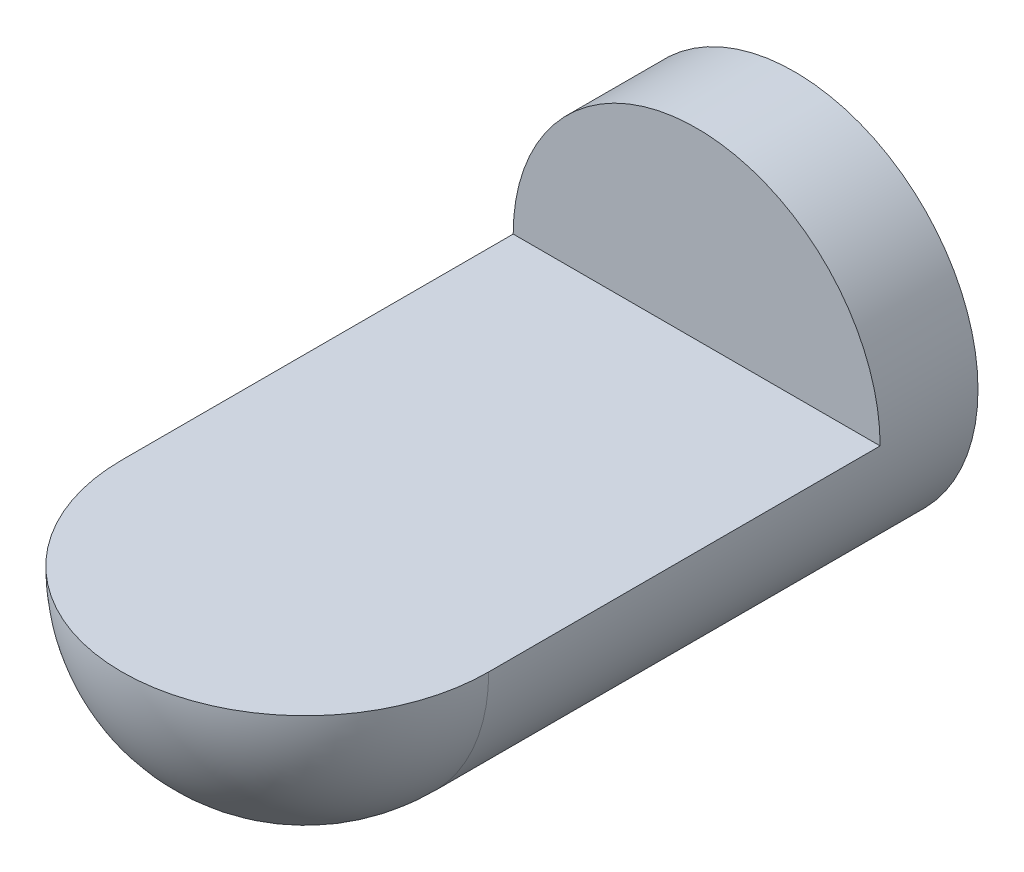
ISO-10303-21;
HEADER;
FILE_DESCRIPTION(('STEP AP214'),'2;1');
FILE_NAME('part.step','',(''),(''),'','','');
FILE_SCHEMA(('AUTOMOTIVE_DESIGN { 1 0 10303 214 1 1 1 1 }'));
ENDSEC;
DATA;
#1=APPLICATION_CONTEXT('core data for automotive mechanical design processes');
#2=APPLICATION_PROTOCOL_DEFINITION('international standard','automotive_design',2000,#1);
#3=PRODUCT_CONTEXT('',#1,'mechanical');
#4=PRODUCT('Part','Part','',(#3));
#5=PRODUCT_RELATED_PRODUCT_CATEGORY('part','',(#4));
#6=PRODUCT_DEFINITION_FORMATION('','',#4);
#7=PRODUCT_DEFINITION_CONTEXT('part definition',#1,'design');
#8=PRODUCT_DEFINITION('design','',#6,#7);
#9=PRODUCT_DEFINITION_SHAPE('','',#8);
#10=(LENGTH_UNIT() NAMED_UNIT(*) SI_UNIT(.MILLI.,.METRE.));
#11=(NAMED_UNIT(*) PLANE_ANGLE_UNIT() SI_UNIT($,.RADIAN.));
#12=(NAMED_UNIT(*) SI_UNIT($,.STERADIAN.) SOLID_ANGLE_UNIT());
#13=UNCERTAINTY_MEASURE_WITH_UNIT(LENGTH_MEASURE(1.E-05),#10,'distance_accuracy_value','');
#14=(GEOMETRIC_REPRESENTATION_CONTEXT(3) GLOBAL_UNCERTAINTY_ASSIGNED_CONTEXT((#13)) GLOBAL_UNIT_ASSIGNED_CONTEXT((#10,
#11,#12)) REPRESENTATION_CONTEXT('',''));
#15=CARTESIAN_POINT('',(0.,0.,0.));
#16=DIRECTION('',(0.,0.,1.));
#17=DIRECTION('',(1.,0.,0.));
#18=AXIS2_PLACEMENT_3D('',#15,#16,#17);
#19=CARTESIAN_POINT('',(0.,0.,0.));
#20=DIRECTION('',(0.,0.,1.));
#21=DIRECTION('',(0.,1.,0.));
#22=AXIS2_PLACEMENT_3D('',#19,#20,#21);
#23=SPHERICAL_SURFACE('',#22,75.);
#24=CARTESIAN_POINT('',(0.,0.,0.));
#25=DIRECTION('',(0.,1.,0.));
#26=DIRECTION('',(0.,0.,1.));
#27=AXIS2_PLACEMENT_3D('',#24,#25,#26);
#28=CIRCLE('',#27,75.);
#29=CARTESIAN_POINT('',(-75.,0.,0.));
#30=VERTEX_POINT('',#29);
#31=CARTESIAN_POINT('',(75.,0.,0.));
#32=VERTEX_POINT('',#31);
#33=EDGE_CURVE('E55',#30,#32,#28,.T.);
#34=ORIENTED_EDGE('',*,*,#33,.F.);
#35=CARTESIAN_POINT('',(0.,0.,0.));
#36=DIRECTION('',(0.,0.,1.));
#37=DIRECTION('',(1.,0.,0.));
#38=AXIS2_PLACEMENT_3D('',#35,#36,#37);
#39=CIRCLE('',#38,75.);
#40=EDGE_CURVE('E76',#30,#32,#39,.T.);
#41=ORIENTED_EDGE('',*,*,#40,.T.);
#42=EDGE_LOOP('',(#34,#41));
#43=FACE_BOUND('',#42,.T.);
#44=ADVANCED_FACE('F36',(#43),#23,.T.);
#45=CARTESIAN_POINT('',(0.,0.,146.909145290857));
#46=DIRECTION('',(0.,0.,1.));
#47=DIRECTION('',(1.,0.,0.));
#48=AXIS2_PLACEMENT_3D('',#45,#46,#47);
#49=CYLINDRICAL_SURFACE('',#48,75.);
#50=CARTESIAN_POINT('',(0.,0.,-200.));
#51=DIRECTION('',(0.,0.,1.));
#52=DIRECTION('',(1.,0.,0.));
#53=AXIS2_PLACEMENT_3D('',#50,#51,#52);
#54=CIRCLE('',#53,75.);
#55=CARTESIAN_POINT('',(75.,0.,-200.));
#56=VERTEX_POINT('',#55);
#57=EDGE_CURVE('E71',#56,#56,#54,.T.);
#58=ORIENTED_EDGE('',*,*,#57,.T.);
#59=EDGE_LOOP('',(#58));
#60=FACE_BOUND('',#59,.T.);
#61=DIRECTION('',(0.,0.,1.));
#62=VECTOR('',#61,1.);
#63=CARTESIAN_POINT('',(75.,0.,146.909145290857));
#64=LINE('',#63,#62);
#65=CARTESIAN_POINT('',(75.,0.,-160.));
#66=VERTEX_POINT('',#65);
#67=EDGE_CURVE('E11',#32,#66,#64,.F.);
#68=ORIENTED_EDGE('',*,*,#67,.F.);
#69=ORIENTED_EDGE('',*,*,#40,.F.);
#70=DIRECTION('',(0.,0.,1.));
#71=VECTOR('',#70,1.);
#72=CARTESIAN_POINT('',(-75.,0.,146.909145290857));
#73=LINE('',#72,#71);
#74=CARTESIAN_POINT('',(-75.,0.,-160.));
#75=VERTEX_POINT('',#74);
#76=EDGE_CURVE('E66',#75,#30,#73,.T.);
#77=ORIENTED_EDGE('',*,*,#76,.F.);
#78=CARTESIAN_POINT('',(0.,0.,-160.));
#79=DIRECTION('',(0.,0.,1.));
#80=DIRECTION('',(1.,0.,0.));
#81=AXIS2_PLACEMENT_3D('',#78,#79,#80);
#82=CIRCLE('',#81,75.);
#83=EDGE_CURVE('E44',#66,#75,#82,.T.);
#84=ORIENTED_EDGE('',*,*,#83,.F.);
#85=EDGE_LOOP('',(#68,#69,#77,#84));
#86=FACE_BOUND('',#85,.T.);
#87=ADVANCED_FACE('F63',(#60,#86),#49,.T.);
#88=CARTESIAN_POINT('',(0.,0.,-200.));
#89=DIRECTION('',(0.,0.,1.));
#90=DIRECTION('',(1.,0.,0.));
#91=AXIS2_PLACEMENT_3D('',#88,#89,#90);
#92=PLANE('',#91);
#93=ORIENTED_EDGE('',*,*,#57,.F.);
#94=EDGE_LOOP('',(#93));
#95=FACE_BOUND('',#94,.T.);
#96=ADVANCED_FACE('F38',(#95),#92,.F.);
#97=CARTESIAN_POINT('',(75.,0.,-160.));
#98=DIRECTION('',(0.,1.,0.));
#99=DIRECTION('',(0.,0.,1.));
#100=AXIS2_PLACEMENT_3D('',#97,#98,#99);
#101=PLANE('',#100);
#102=ORIENTED_EDGE('',*,*,#33,.T.);
#103=ORIENTED_EDGE('',*,*,#67,.T.);
#104=DIRECTION('',(-1.,0.,0.));
#105=VECTOR('',#104,1.);
#106=CARTESIAN_POINT('',(75.,0.,-160.));
#107=LINE('',#106,#105);
#108=EDGE_CURVE('E50',#66,#75,#107,.T.);
#109=ORIENTED_EDGE('',*,*,#108,.T.);
#110=ORIENTED_EDGE('',*,*,#76,.T.);
#111=EDGE_LOOP('',(#102,#103,#109,#110));
#112=FACE_BOUND('',#111,.T.);
#113=ADVANCED_FACE('F68',(#112),#101,.T.);
#114=CARTESIAN_POINT('',(75.,0.,-160.));
#115=DIRECTION('',(0.,0.,1.));
#116=DIRECTION('',(1.,0.,0.));
#117=AXIS2_PLACEMENT_3D('',#114,#115,#116);
#118=PLANE('',#117);
#119=ORIENTED_EDGE('',*,*,#108,.F.);
#120=ORIENTED_EDGE('',*,*,#83,.T.);
#121=EDGE_LOOP('',(#119,#120));
#122=FACE_BOUND('',#121,.T.);
#123=ADVANCED_FACE('F69',(#122),#118,.T.);
#124=CLOSED_SHELL('',(#44,#87,#96,#113,#123));
#125=MANIFOLD_SOLID_BREP('B2',#124);
#126=ADVANCED_BREP_SHAPE_REPRESENTATION('',(#18,#125),#14);
#127=SHAPE_DEFINITION_REPRESENTATION(#9,#126);
ENDSEC;
END-ISO-10303-21;
